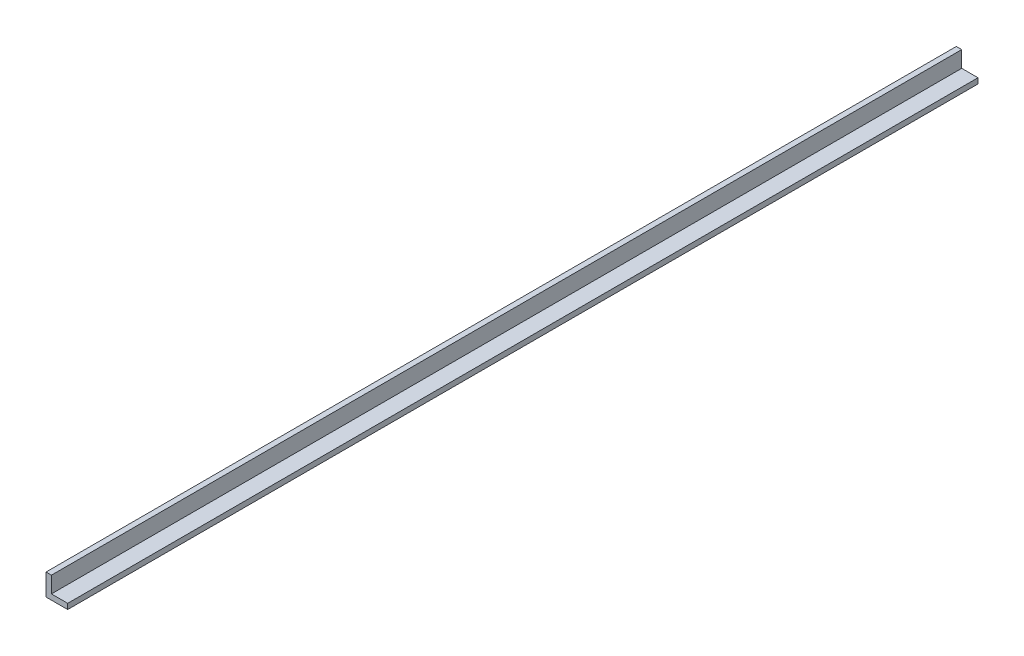
ISO-10303-21;
HEADER;
FILE_DESCRIPTION(('STEP AP214'),'2;1');
FILE_NAME('part.step','',(''),(''),'','','');
FILE_SCHEMA(('AUTOMOTIVE_DESIGN { 1 0 10303 214 1 1 1 1 }'));
ENDSEC;
DATA;
#1=APPLICATION_CONTEXT('core data for automotive mechanical design processes');
#2=APPLICATION_PROTOCOL_DEFINITION('international standard','automotive_design',2000,#1);
#3=PRODUCT_CONTEXT('',#1,'mechanical');
#4=PRODUCT('Part','Part','',(#3));
#5=PRODUCT_RELATED_PRODUCT_CATEGORY('part','',(#4));
#6=PRODUCT_DEFINITION_FORMATION('','',#4);
#7=PRODUCT_DEFINITION_CONTEXT('part definition',#1,'design');
#8=PRODUCT_DEFINITION('design','',#6,#7);
#9=PRODUCT_DEFINITION_SHAPE('','',#8);
#10=(LENGTH_UNIT() NAMED_UNIT(*) SI_UNIT(.MILLI.,.METRE.));
#11=(NAMED_UNIT(*) PLANE_ANGLE_UNIT() SI_UNIT($,.RADIAN.));
#12=(NAMED_UNIT(*) SI_UNIT($,.STERADIAN.) SOLID_ANGLE_UNIT());
#13=UNCERTAINTY_MEASURE_WITH_UNIT(LENGTH_MEASURE(1.E-05),#10,'distance_accuracy_value','');
#14=(GEOMETRIC_REPRESENTATION_CONTEXT(3) GLOBAL_UNCERTAINTY_ASSIGNED_CONTEXT((#13)) GLOBAL_UNIT_ASSIGNED_CONTEXT((#10,
#11,#12)) REPRESENTATION_CONTEXT('',''));
#15=CARTESIAN_POINT('',(0.,0.,0.));
#16=DIRECTION('',(0.,0.,1.));
#17=DIRECTION('',(1.,0.,0.));
#18=AXIS2_PLACEMENT_3D('',#15,#16,#17);
#19=CARTESIAN_POINT('',(25.4,6.35,0.));
#20=DIRECTION('',(0.,1.,0.));
#21=DIRECTION('',(0.,0.,1.));
#22=AXIS2_PLACEMENT_3D('',#19,#20,#21);
#23=PLANE('',#22);
#24=DIRECTION('',(0.,0.,-1.));
#25=VECTOR('',#24,1.);
#26=CARTESIAN_POINT('',(25.4,6.35,0.));
#27=LINE('',#26,#25);
#28=CARTESIAN_POINT('',(25.4,6.35,0.));
#29=VERTEX_POINT('',#28);
#30=CARTESIAN_POINT('',(25.4,6.35,1066.8));
#31=VERTEX_POINT('',#30);
#32=EDGE_CURVE('E71',#29,#31,#27,.F.);
#33=ORIENTED_EDGE('',*,*,#32,.F.);
#34=DIRECTION('',(1.,0.,0.));
#35=VECTOR('',#34,1.);
#36=CARTESIAN_POINT('',(0.,6.35,0.));
#37=LINE('',#36,#35);
#38=CARTESIAN_POINT('',(6.35,6.35,0.));
#39=VERTEX_POINT('',#38);
#40=EDGE_CURVE('E103',#29,#39,#37,.F.);
#41=ORIENTED_EDGE('',*,*,#40,.T.);
#42=DIRECTION('',(0.,0.,-1.));
#43=VECTOR('',#42,1.);
#44=CARTESIAN_POINT('',(6.35,6.35,0.));
#45=LINE('',#44,#43);
#46=CARTESIAN_POINT('',(6.35,6.35,1066.8));
#47=VERTEX_POINT('',#46);
#48=EDGE_CURVE('E19',#47,#39,#45,.T.);
#49=ORIENTED_EDGE('',*,*,#48,.F.);
#50=DIRECTION('',(1.,0.,0.));
#51=VECTOR('',#50,1.);
#52=CARTESIAN_POINT('',(0.,6.35,1066.8));
#53=LINE('',#52,#51);
#54=EDGE_CURVE('E82',#31,#47,#53,.F.);
#55=ORIENTED_EDGE('',*,*,#54,.F.);
#56=EDGE_LOOP('',(#33,#41,#49,#55));
#57=FACE_BOUND('',#56,.T.);
#58=ADVANCED_FACE('F16',(#57),#23,.T.);
#59=CARTESIAN_POINT('',(6.35,6.35,0.));
#60=DIRECTION('',(1.,0.,0.));
#61=DIRECTION('',(0.,0.,-1.));
#62=AXIS2_PLACEMENT_3D('',#59,#60,#61);
#63=PLANE('',#62);
#64=ORIENTED_EDGE('',*,*,#48,.T.);
#65=DIRECTION('',(0.,1.,0.));
#66=VECTOR('',#65,1.);
#67=CARTESIAN_POINT('',(6.35,0.,0.));
#68=LINE('',#67,#66);
#69=CARTESIAN_POINT('',(6.35,25.4,0.));
#70=VERTEX_POINT('',#69);
#71=EDGE_CURVE('E100',#39,#70,#68,.T.);
#72=ORIENTED_EDGE('',*,*,#71,.T.);
#73=DIRECTION('',(0.,0.,1.));
#74=VECTOR('',#73,1.);
#75=CARTESIAN_POINT('',(6.35,25.4,0.));
#76=LINE('',#75,#74);
#77=CARTESIAN_POINT('',(6.35,25.4,1066.8));
#78=VERTEX_POINT('',#77);
#79=EDGE_CURVE('E79',#78,#70,#76,.F.);
#80=ORIENTED_EDGE('',*,*,#79,.F.);
#81=DIRECTION('',(0.,1.,0.));
#82=VECTOR('',#81,1.);
#83=CARTESIAN_POINT('',(6.35,0.,1066.8));
#84=LINE('',#83,#82);
#85=EDGE_CURVE('E85',#47,#78,#84,.T.);
#86=ORIENTED_EDGE('',*,*,#85,.F.);
#87=EDGE_LOOP('',(#64,#72,#80,#86));
#88=FACE_BOUND('',#87,.T.);
#89=ADVANCED_FACE('F99',(#88),#63,.T.);
#90=CARTESIAN_POINT('',(6.35,25.4,0.));
#91=DIRECTION('',(0.,1.,0.));
#92=DIRECTION('',(0.,0.,1.));
#93=AXIS2_PLACEMENT_3D('',#90,#91,#92);
#94=PLANE('',#93);
#95=ORIENTED_EDGE('',*,*,#79,.T.);
#96=DIRECTION('',(1.,0.,0.));
#97=VECTOR('',#96,1.);
#98=CARTESIAN_POINT('',(0.,25.4,0.));
#99=LINE('',#98,#97);
#100=CARTESIAN_POINT('',(0.,25.4,0.));
#101=VERTEX_POINT('',#100);
#102=EDGE_CURVE('E104',#70,#101,#99,.F.);
#103=ORIENTED_EDGE('',*,*,#102,.T.);
#104=DIRECTION('',(0.,0.,1.));
#105=VECTOR('',#104,1.);
#106=CARTESIAN_POINT('',(0.,25.4,0.));
#107=LINE('',#106,#105);
#108=CARTESIAN_POINT('',(0.,25.4,1066.8));
#109=VERTEX_POINT('',#108);
#110=EDGE_CURVE('E111',#109,#101,#107,.F.);
#111=ORIENTED_EDGE('',*,*,#110,.F.);
#112=DIRECTION('',(1.,0.,0.));
#113=VECTOR('',#112,1.);
#114=CARTESIAN_POINT('',(0.,25.4,1066.8));
#115=LINE('',#114,#113);
#116=EDGE_CURVE('E116',#78,#109,#115,.F.);
#117=ORIENTED_EDGE('',*,*,#116,.F.);
#118=EDGE_LOOP('',(#95,#103,#111,#117));
#119=FACE_BOUND('',#118,.T.);
#120=ADVANCED_FACE('F118',(#119),#94,.T.);
#121=CARTESIAN_POINT('',(25.4,0.,0.));
#122=DIRECTION('',(1.,0.,0.));
#123=DIRECTION('',(0.,0.,-1.));
#124=AXIS2_PLACEMENT_3D('',#121,#122,#123);
#125=PLANE('',#124);
#126=DIRECTION('',(0.,0.,-1.));
#127=VECTOR('',#126,1.);
#128=CARTESIAN_POINT('',(25.4,0.,0.));
#129=LINE('',#128,#127);
#130=CARTESIAN_POINT('',(25.4,0.,0.));
#131=VERTEX_POINT('',#130);
#132=CARTESIAN_POINT('',(25.4,0.,1066.8));
#133=VERTEX_POINT('',#132);
#134=EDGE_CURVE('E124',#131,#133,#129,.F.);
#135=ORIENTED_EDGE('',*,*,#134,.F.);
#136=DIRECTION('',(0.,1.,0.));
#137=VECTOR('',#136,1.);
#138=CARTESIAN_POINT('',(25.4,0.,0.));
#139=LINE('',#138,#137);
#140=EDGE_CURVE('E77',#131,#29,#139,.T.);
#141=ORIENTED_EDGE('',*,*,#140,.T.);
#142=ORIENTED_EDGE('',*,*,#32,.T.);
#143=DIRECTION('',(0.,1.,0.));
#144=VECTOR('',#143,1.);
#145=CARTESIAN_POINT('',(25.4,0.,1066.8));
#146=LINE('',#145,#144);
#147=EDGE_CURVE('E74',#133,#31,#146,.T.);
#148=ORIENTED_EDGE('',*,*,#147,.F.);
#149=EDGE_LOOP('',(#135,#141,#142,#148));
#150=FACE_BOUND('',#149,.T.);
#151=ADVANCED_FACE('F72',(#150),#125,.T.);
#152=CARTESIAN_POINT('',(0.,0.,1066.8));
#153=DIRECTION('',(0.,0.,1.));
#154=DIRECTION('',(1.,0.,0.));
#155=AXIS2_PLACEMENT_3D('',#152,#153,#154);
#156=PLANE('',#155);
#157=DIRECTION('',(0.,1.,0.));
#158=VECTOR('',#157,1.);
#159=CARTESIAN_POINT('',(0.,25.4,1066.8));
#160=LINE('',#159,#158);
#161=CARTESIAN_POINT('',(0.,0.,1066.8));
#162=VERTEX_POINT('',#161);
#163=EDGE_CURVE('E113',#162,#109,#160,.T.);
#164=ORIENTED_EDGE('',*,*,#163,.F.);
#165=DIRECTION('',(1.,0.,0.));
#166=VECTOR('',#165,1.);
#167=CARTESIAN_POINT('',(0.,0.,1066.8));
#168=LINE('',#167,#166);
#169=EDGE_CURVE('E89',#133,#162,#168,.F.);
#170=ORIENTED_EDGE('',*,*,#169,.F.);
#171=ORIENTED_EDGE('',*,*,#147,.T.);
#172=ORIENTED_EDGE('',*,*,#54,.T.);
#173=ORIENTED_EDGE('',*,*,#85,.T.);
#174=ORIENTED_EDGE('',*,*,#116,.T.);
#175=EDGE_LOOP('',(#164,#170,#171,#172,#173,#174));
#176=FACE_BOUND('',#175,.T.);
#177=ADVANCED_FACE('F87',(#176),#156,.T.);
#178=CARTESIAN_POINT('',(0.,25.4,0.));
#179=DIRECTION('',(-1.,0.,0.));
#180=DIRECTION('',(0.,0.,1.));
#181=AXIS2_PLACEMENT_3D('',#178,#179,#180);
#182=PLANE('',#181);
#183=ORIENTED_EDGE('',*,*,#110,.T.);
#184=DIRECTION('',(0.,1.,0.));
#185=VECTOR('',#184,1.);
#186=CARTESIAN_POINT('',(0.,0.,0.));
#187=LINE('',#186,#185);
#188=CARTESIAN_POINT('',(0.,0.,0.));
#189=VERTEX_POINT('',#188);
#190=EDGE_CURVE('E34',#101,#189,#187,.F.);
#191=ORIENTED_EDGE('',*,*,#190,.T.);
#192=DIRECTION('',(0.,0.,-1.));
#193=VECTOR('',#192,1.);
#194=CARTESIAN_POINT('',(0.,0.,0.));
#195=LINE('',#194,#193);
#196=EDGE_CURVE('E25',#162,#189,#195,.T.);
#197=ORIENTED_EDGE('',*,*,#196,.F.);
#198=ORIENTED_EDGE('',*,*,#163,.T.);
#199=EDGE_LOOP('',(#183,#191,#197,#198));
#200=FACE_BOUND('',#199,.T.);
#201=ADVANCED_FACE('F119',(#200),#182,.T.);
#202=CARTESIAN_POINT('',(0.,0.,0.));
#203=DIRECTION('',(0.,0.,1.));
#204=DIRECTION('',(1.,0.,0.));
#205=AXIS2_PLACEMENT_3D('',#202,#203,#204);
#206=PLANE('',#205);
#207=ORIENTED_EDGE('',*,*,#102,.F.);
#208=ORIENTED_EDGE('',*,*,#71,.F.);
#209=ORIENTED_EDGE('',*,*,#40,.F.);
#210=ORIENTED_EDGE('',*,*,#140,.F.);
#211=DIRECTION('',(1.,0.,0.));
#212=VECTOR('',#211,1.);
#213=CARTESIAN_POINT('',(0.,0.,0.));
#214=LINE('',#213,#212);
#215=EDGE_CURVE('E11',#189,#131,#214,.T.);
#216=ORIENTED_EDGE('',*,*,#215,.F.);
#217=ORIENTED_EDGE('',*,*,#190,.F.);
#218=EDGE_LOOP('',(#207,#208,#209,#210,#216,#217));
#219=FACE_BOUND('',#218,.T.);
#220=ADVANCED_FACE('F102',(#219),#206,.F.);
#221=CARTESIAN_POINT('',(0.,0.,0.));
#222=DIRECTION('',(0.,-1.,0.));
#223=DIRECTION('',(0.,0.,-1.));
#224=AXIS2_PLACEMENT_3D('',#221,#222,#223);
#225=PLANE('',#224);
#226=ORIENTED_EDGE('',*,*,#196,.T.);
#227=ORIENTED_EDGE('',*,*,#215,.T.);
#228=ORIENTED_EDGE('',*,*,#134,.T.);
#229=ORIENTED_EDGE('',*,*,#169,.T.);
#230=EDGE_LOOP('',(#226,#227,#228,#229));
#231=FACE_BOUND('',#230,.T.);
#232=ADVANCED_FACE('F123',(#231),#225,.T.);
#233=CLOSED_SHELL('',(#58,#89,#120,#151,#177,#201,#220,#232));
#234=MANIFOLD_SOLID_BREP('B1',#233);
#235=ADVANCED_BREP_SHAPE_REPRESENTATION('',(#18,#234),#14);
#236=SHAPE_DEFINITION_REPRESENTATION(#9,#235);
ENDSEC;
END-ISO-10303-21;
